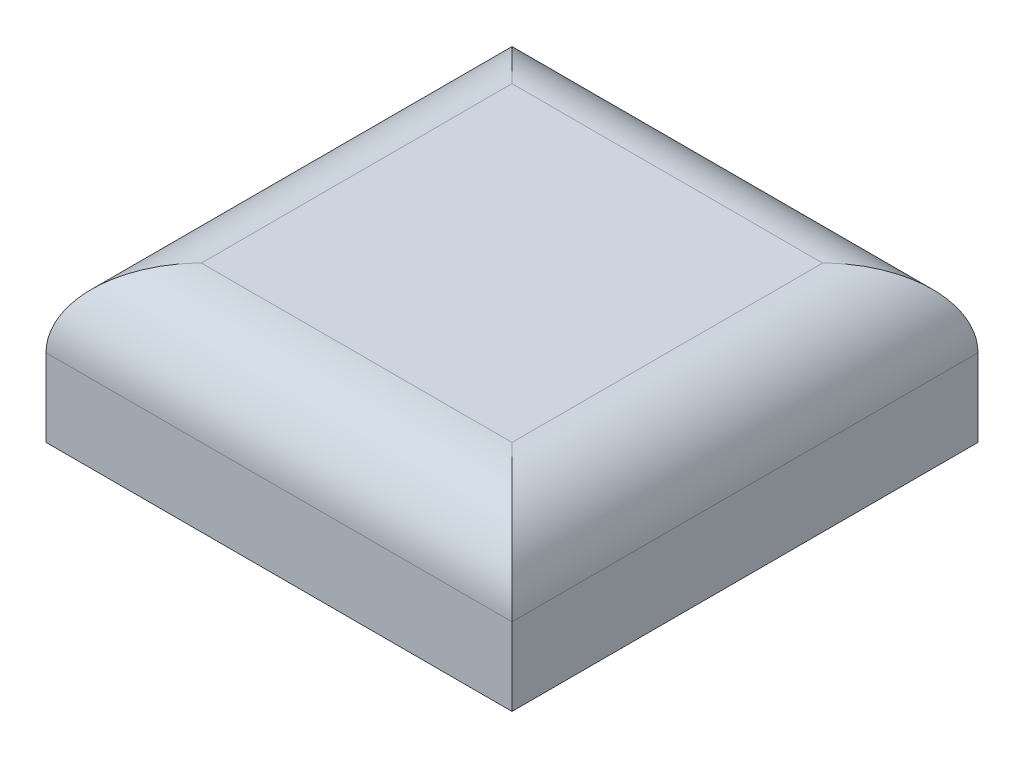
ISO-10303-21;
HEADER;
FILE_DESCRIPTION(('STEP AP214'),'2;1');
FILE_NAME('part.step','',(''),(''),'','','');
FILE_SCHEMA(('AUTOMOTIVE_DESIGN { 1 0 10303 214 1 1 1 1 }'));
ENDSEC;
DATA;
#1=APPLICATION_CONTEXT('core data for automotive mechanical design processes');
#2=APPLICATION_PROTOCOL_DEFINITION('international standard','automotive_design',2000,#1);
#3=PRODUCT_CONTEXT('',#1,'mechanical');
#4=PRODUCT('Part','Part','',(#3));
#5=PRODUCT_RELATED_PRODUCT_CATEGORY('part','',(#4));
#6=PRODUCT_DEFINITION_FORMATION('','',#4);
#7=PRODUCT_DEFINITION_CONTEXT('part definition',#1,'design');
#8=PRODUCT_DEFINITION('design','',#6,#7);
#9=PRODUCT_DEFINITION_SHAPE('','',#8);
#10=(LENGTH_UNIT() NAMED_UNIT(*) SI_UNIT(.MILLI.,.METRE.));
#11=(NAMED_UNIT(*) PLANE_ANGLE_UNIT() SI_UNIT($,.RADIAN.));
#12=(NAMED_UNIT(*) SI_UNIT($,.STERADIAN.) SOLID_ANGLE_UNIT());
#13=UNCERTAINTY_MEASURE_WITH_UNIT(LENGTH_MEASURE(1.E-05),#10,'distance_accuracy_value','');
#14=(GEOMETRIC_REPRESENTATION_CONTEXT(3) GLOBAL_UNCERTAINTY_ASSIGNED_CONTEXT((#13)) GLOBAL_UNIT_ASSIGNED_CONTEXT((#10,
#11,#12)) REPRESENTATION_CONTEXT('',''));
#15=CARTESIAN_POINT('',(0.,0.,0.));
#16=DIRECTION('',(0.,0.,1.));
#17=DIRECTION('',(1.,0.,0.));
#18=AXIS2_PLACEMENT_3D('',#15,#16,#17);
#19=CARTESIAN_POINT('',(-3.02307692307692,4.,-8.33076923076923));
#20=DIRECTION('',(-1.,0.,0.));
#21=DIRECTION('',(0.,0.,1.));
#22=AXIS2_PLACEMENT_3D('',#19,#20,#21);
#23=PLANE('',#22);
#24=DIRECTION('',(0.,-1.,0.));
#25=VECTOR('',#24,1.);
#26=CARTESIAN_POINT('',(-3.02307692307692,4.,-8.33076923076923));
#27=LINE('',#26,#25);
#28=CARTESIAN_POINT('',(-3.02307692307692,2.,-8.33076923076923));
#29=VERTEX_POINT('',#28);
#30=CARTESIAN_POINT('',(-3.02307692307692,0.,-8.33076923076923));
#31=VERTEX_POINT('',#30);
#32=EDGE_CURVE('E90',#29,#31,#27,.T.);
#33=ORIENTED_EDGE('',*,*,#32,.F.);
#34=DIRECTION('',(0.,0.,-1.));
#35=VECTOR('',#34,1.);
#36=CARTESIAN_POINT('',(-3.02307692307692,2.,3.66923076923077));
#37=LINE('',#36,#35);
#38=CARTESIAN_POINT('',(-3.02307692307692,2.,3.66923076923077));
#39=VERTEX_POINT('',#38);
#40=EDGE_CURVE('E60',#29,#39,#37,.F.);
#41=ORIENTED_EDGE('',*,*,#40,.T.);
#42=DIRECTION('',(0.,-1.,0.));
#43=VECTOR('',#42,1.);
#44=CARTESIAN_POINT('',(-3.02307692307692,4.,3.66923076923077));
#45=LINE('',#44,#43);
#46=CARTESIAN_POINT('',(-3.02307692307692,0.,3.66923076923077));
#47=VERTEX_POINT('',#46);
#48=EDGE_CURVE('E110',#39,#47,#45,.T.);
#49=ORIENTED_EDGE('',*,*,#48,.T.);
#50=DIRECTION('',(0.,0.,-1.));
#51=VECTOR('',#50,1.);
#52=CARTESIAN_POINT('',(-3.02307692307692,0.,-8.33076923076923));
#53=LINE('',#52,#51);
#54=EDGE_CURVE('E106',#47,#31,#53,.T.);
#55=ORIENTED_EDGE('',*,*,#54,.T.);
#56=EDGE_LOOP('',(#33,#41,#49,#55));
#57=FACE_BOUND('',#56,.T.);
#58=ADVANCED_FACE('F36',(#57),#23,.F.);
#59=CARTESIAN_POINT('',(-15.0230769230769,4.,-8.33076923076923));
#60=DIRECTION('',(0.,0.,1.));
#61=DIRECTION('',(1.,0.,0.));
#62=AXIS2_PLACEMENT_3D('',#59,#60,#61);
#63=PLANE('',#62);
#64=DIRECTION('',(0.,-1.,0.));
#65=VECTOR('',#64,1.);
#66=CARTESIAN_POINT('',(-15.0230769230769,4.,-8.33076923076923));
#67=LINE('',#66,#65);
#68=CARTESIAN_POINT('',(-15.0230769230769,2.,-8.33076923076923));
#69=VERTEX_POINT('',#68);
#70=CARTESIAN_POINT('',(-15.0230769230769,0.,-8.33076923076923));
#71=VERTEX_POINT('',#70);
#72=EDGE_CURVE('E100',#69,#71,#67,.T.);
#73=ORIENTED_EDGE('',*,*,#72,.F.);
#74=DIRECTION('',(-1.,0.,0.));
#75=VECTOR('',#74,1.);
#76=CARTESIAN_POINT('',(-3.02307692307692,2.,-8.33076923076923));
#77=LINE('',#76,#75);
#78=EDGE_CURVE('E97',#69,#29,#77,.F.);
#79=ORIENTED_EDGE('',*,*,#78,.T.);
#80=ORIENTED_EDGE('',*,*,#32,.T.);
#81=DIRECTION('',(-1.,0.,0.));
#82=VECTOR('',#81,1.);
#83=CARTESIAN_POINT('',(-15.0230769230769,0.,-8.33076923076923));
#84=LINE('',#83,#82);
#85=EDGE_CURVE('E94',#31,#71,#84,.T.);
#86=ORIENTED_EDGE('',*,*,#85,.T.);
#87=EDGE_LOOP('',(#73,#79,#80,#86));
#88=FACE_BOUND('',#87,.T.);
#89=ADVANCED_FACE('F93',(#88),#63,.F.);
#90=CARTESIAN_POINT('',(-15.0230769230769,4.,-8.33076923076923));
#91=DIRECTION('',(1.,0.,0.));
#92=DIRECTION('',(0.,0.,-1.));
#93=AXIS2_PLACEMENT_3D('',#90,#91,#92);
#94=PLANE('',#93);
#95=DIRECTION('',(0.,-1.,0.));
#96=VECTOR('',#95,1.);
#97=CARTESIAN_POINT('',(-15.0230769230769,4.,3.66923076923077));
#98=LINE('',#97,#96);
#99=CARTESIAN_POINT('',(-15.0230769230769,2.,3.66923076923077));
#100=VERTEX_POINT('',#99);
#101=CARTESIAN_POINT('',(-15.0230769230769,0.,3.66923076923077));
#102=VERTEX_POINT('',#101);
#103=EDGE_CURVE('E123',#100,#102,#98,.T.);
#104=ORIENTED_EDGE('',*,*,#103,.F.);
#105=DIRECTION('',(0.,0.,1.));
#106=VECTOR('',#105,1.);
#107=CARTESIAN_POINT('',(-15.0230769230769,2.,-8.33076923076923));
#108=LINE('',#107,#106);
#109=EDGE_CURVE('E11',#100,#69,#108,.F.);
#110=ORIENTED_EDGE('',*,*,#109,.T.);
#111=ORIENTED_EDGE('',*,*,#72,.T.);
#112=DIRECTION('',(0.,0.,1.));
#113=VECTOR('',#112,1.);
#114=CARTESIAN_POINT('',(-15.0230769230769,0.,-8.33076923076923));
#115=LINE('',#114,#113);
#116=EDGE_CURVE('E108',#71,#102,#115,.T.);
#117=ORIENTED_EDGE('',*,*,#116,.T.);
#118=EDGE_LOOP('',(#104,#110,#111,#117));
#119=FACE_BOUND('',#118,.T.);
#120=ADVANCED_FACE('F174',(#119),#94,.F.);
#121=CARTESIAN_POINT('',(-15.0230769230769,4.,3.66923076923077));
#122=DIRECTION('',(0.,0.,-1.));
#123=DIRECTION('',(-1.,0.,0.));
#124=AXIS2_PLACEMENT_3D('',#121,#122,#123);
#125=PLANE('',#124);
#126=ORIENTED_EDGE('',*,*,#48,.F.);
#127=DIRECTION('',(1.,0.,0.));
#128=VECTOR('',#127,1.);
#129=CARTESIAN_POINT('',(-15.0230769230769,2.,3.66923076923077));
#130=LINE('',#129,#128);
#131=EDGE_CURVE('E45',#39,#100,#130,.F.);
#132=ORIENTED_EDGE('',*,*,#131,.T.);
#133=ORIENTED_EDGE('',*,*,#103,.T.);
#134=DIRECTION('',(1.,0.,0.));
#135=VECTOR('',#134,1.);
#136=CARTESIAN_POINT('',(-15.0230769230769,0.,3.66923076923077));
#137=LINE('',#136,#135);
#138=EDGE_CURVE('E120',#102,#47,#137,.T.);
#139=ORIENTED_EDGE('',*,*,#138,.T.);
#140=EDGE_LOOP('',(#126,#132,#133,#139));
#141=FACE_BOUND('',#140,.T.);
#142=ADVANCED_FACE('F165',(#141),#125,.F.);
#143=CARTESIAN_POINT('',(0.,4.,0.));
#144=DIRECTION('',(0.,1.,0.));
#145=DIRECTION('',(0.,0.,1.));
#146=AXIS2_PLACEMENT_3D('',#143,#144,#145);
#147=PLANE('',#146);
#148=DIRECTION('',(0.,0.,-1.));
#149=VECTOR('',#148,1.);
#150=CARTESIAN_POINT('',(-5.02307692307692,4.,-8.33076923076923));
#151=LINE('',#150,#149);
#152=CARTESIAN_POINT('',(-5.02307692307692,4.,1.66923076923077));
#153=VERTEX_POINT('',#152);
#154=CARTESIAN_POINT('',(-5.02307692307692,4.,-6.33076923076923));
#155=VERTEX_POINT('',#154);
#156=EDGE_CURVE('E129',#153,#155,#151,.T.);
#157=ORIENTED_EDGE('',*,*,#156,.T.);
#158=DIRECTION('',(-1.,0.,0.));
#159=VECTOR('',#158,1.);
#160=CARTESIAN_POINT('',(-15.0230769230769,4.,-6.33076923076923));
#161=LINE('',#160,#159);
#162=CARTESIAN_POINT('',(-13.0230769230769,4.,-6.33076923076923));
#163=VERTEX_POINT('',#162);
#164=EDGE_CURVE('E131',#155,#163,#161,.T.);
#165=ORIENTED_EDGE('',*,*,#164,.T.);
#166=DIRECTION('',(0.,0.,1.));
#167=VECTOR('',#166,1.);
#168=CARTESIAN_POINT('',(-13.0230769230769,4.,3.66923076923077));
#169=LINE('',#168,#167);
#170=CARTESIAN_POINT('',(-13.0230769230769,4.,1.66923076923077));
#171=VERTEX_POINT('',#170);
#172=EDGE_CURVE('E99',#163,#171,#169,.T.);
#173=ORIENTED_EDGE('',*,*,#172,.T.);
#174=DIRECTION('',(1.,0.,0.));
#175=VECTOR('',#174,1.);
#176=CARTESIAN_POINT('',(-3.02307692307692,4.,1.66923076923077));
#177=LINE('',#176,#175);
#178=EDGE_CURVE('E127',#171,#153,#177,.T.);
#179=ORIENTED_EDGE('',*,*,#178,.T.);
#180=EDGE_LOOP('',(#157,#165,#173,#179));
#181=FACE_BOUND('',#180,.T.);
#182=ADVANCED_FACE('F156',(#181),#147,.T.);
#183=CARTESIAN_POINT('',(0.,0.,0.));
#184=DIRECTION('',(0.,1.,0.));
#185=DIRECTION('',(0.,0.,1.));
#186=AXIS2_PLACEMENT_3D('',#183,#184,#185);
#187=PLANE('',#186);
#188=CARTESIAN_POINT('',(-9.02307692307692,0.,-2.33076923076923));
#189=DIRECTION('',(0.,-1.,0.));
#190=DIRECTION('',(0.,0.,-1.));
#191=AXIS2_PLACEMENT_3D('',#188,#189,#190);
#192=CIRCLE('',#191,2.);
#193=CARTESIAN_POINT('',(-9.02307692307692,0.,-4.33076923076923));
#194=VERTEX_POINT('',#193);
#195=EDGE_CURVE('E115',#194,#194,#192,.T.);
#196=ORIENTED_EDGE('',*,*,#195,.F.);
#197=EDGE_LOOP('',(#196));
#198=FACE_BOUND('',#197,.T.);
#199=ORIENTED_EDGE('',*,*,#54,.F.);
#200=ORIENTED_EDGE('',*,*,#138,.F.);
#201=ORIENTED_EDGE('',*,*,#116,.F.);
#202=ORIENTED_EDGE('',*,*,#85,.F.);
#203=EDGE_LOOP('',(#199,#200,#201,#202));
#204=FACE_BOUND('',#203,.T.);
#205=ADVANCED_FACE('F104',(#198,#204),#187,.F.);
#206=CARTESIAN_POINT('',(-9.02307692307692,2.,-2.33076923076923));
#207=DIRECTION('',(0.,-1.,0.));
#208=DIRECTION('',(0.,0.,-1.));
#209=AXIS2_PLACEMENT_3D('',#206,#207,#208);
#210=CYLINDRICAL_SURFACE('',#209,2.);
#211=CARTESIAN_POINT('',(-9.02307692307692,2.,-2.33076923076923));
#212=DIRECTION('',(0.,-1.,0.));
#213=DIRECTION('',(0.,0.,-1.));
#214=AXIS2_PLACEMENT_3D('',#211,#212,#213);
#215=CIRCLE('',#214,2.);
#216=CARTESIAN_POINT('',(-9.02307692307692,2.,-4.33076923076923));
#217=VERTEX_POINT('',#216);
#218=EDGE_CURVE('E112',#217,#217,#215,.T.);
#219=ORIENTED_EDGE('',*,*,#218,.F.);
#220=EDGE_LOOP('',(#219));
#221=FACE_BOUND('',#220,.T.);
#222=ORIENTED_EDGE('',*,*,#195,.T.);
#223=EDGE_LOOP('',(#222));
#224=FACE_BOUND('',#223,.T.);
#225=ADVANCED_FACE('F153',(#221,#224),#210,.F.);
#226=CARTESIAN_POINT('',(-9.02307692307692,2.,-2.33076923076923));
#227=DIRECTION('',(0.,-1.,0.));
#228=DIRECTION('',(0.,0.,-1.));
#229=AXIS2_PLACEMENT_3D('',#226,#227,#228);
#230=PLANE('',#229);
#231=ORIENTED_EDGE('',*,*,#218,.T.);
#232=EDGE_LOOP('',(#231));
#233=FACE_BOUND('',#232,.T.);
#234=ADVANCED_FACE('F162',(#233),#230,.T.);
#235=CARTESIAN_POINT('',(0.,2.,1.66923076923077));
#236=DIRECTION('',(-1.,0.,0.));
#237=DIRECTION('',(0.,0.,1.));
#238=AXIS2_PLACEMENT_3D('',#235,#236,#237);
#239=CYLINDRICAL_SURFACE('',#238,2.);
#240=CARTESIAN_POINT('',(-13.0230769230769,2.,1.66923076923077));
#241=DIRECTION('',(-0.707106781186548,0.,-0.707106781186547));
#242=DIRECTION('',(0.707106781186547,0.,-0.707106781186548));
#243=AXIS2_PLACEMENT_3D('',#240,#241,#242);
#244=ELLIPSE('',#243,2.82842712474619,2.);
#245=EDGE_CURVE('E140',#100,#171,#244,.T.);
#246=ORIENTED_EDGE('',*,*,#245,.F.);
#247=ORIENTED_EDGE('',*,*,#131,.F.);
#248=CARTESIAN_POINT('',(-5.02307692307692,2.,1.66923076923077));
#249=DIRECTION('',(-0.707106781186547,0.,0.707106781186548));
#250=DIRECTION('',(-0.707106781186548,0.,-0.707106781186547));
#251=AXIS2_PLACEMENT_3D('',#248,#249,#250);
#252=ELLIPSE('',#251,2.82842712474619,2.);
#253=EDGE_CURVE('E40',#153,#39,#252,.F.);
#254=ORIENTED_EDGE('',*,*,#253,.F.);
#255=ORIENTED_EDGE('',*,*,#178,.F.);
#256=EDGE_LOOP('',(#246,#247,#254,#255));
#257=FACE_BOUND('',#256,.T.);
#258=ADVANCED_FACE('F38',(#257),#239,.T.);
#259=CARTESIAN_POINT('',(-5.02307692307692,2.,0.));
#260=DIRECTION('',(0.,0.,1.));
#261=DIRECTION('',(1.,0.,0.));
#262=AXIS2_PLACEMENT_3D('',#259,#260,#261);
#263=CYLINDRICAL_SURFACE('',#262,2.);
#264=ORIENTED_EDGE('',*,*,#253,.T.);
#265=ORIENTED_EDGE('',*,*,#40,.F.);
#266=CARTESIAN_POINT('',(-5.02307692307692,2.,-6.33076923076923));
#267=DIRECTION('',(0.707106781186548,0.,0.707106781186547));
#268=DIRECTION('',(-0.707106781186547,0.,0.707106781186548));
#269=AXIS2_PLACEMENT_3D('',#266,#267,#268);
#270=ELLIPSE('',#269,2.82842712474619,2.);
#271=EDGE_CURVE('E139',#155,#29,#270,.F.);
#272=ORIENTED_EDGE('',*,*,#271,.F.);
#273=ORIENTED_EDGE('',*,*,#156,.F.);
#274=EDGE_LOOP('',(#264,#265,#272,#273));
#275=FACE_BOUND('',#274,.T.);
#276=ADVANCED_FACE('F184',(#275),#263,.T.);
#277=CARTESIAN_POINT('',(-13.0230769230769,2.,0.));
#278=DIRECTION('',(0.,0.,-1.));
#279=DIRECTION('',(-1.,0.,0.));
#280=AXIS2_PLACEMENT_3D('',#277,#278,#279);
#281=CYLINDRICAL_SURFACE('',#280,2.);
#282=ORIENTED_EDGE('',*,*,#245,.T.);
#283=ORIENTED_EDGE('',*,*,#172,.F.);
#284=CARTESIAN_POINT('',(-13.0230769230769,2.,-6.33076923076923));
#285=DIRECTION('',(0.707106781186547,0.,-0.707106781186548));
#286=DIRECTION('',(-0.707106781186548,0.,-0.707106781186547));
#287=AXIS2_PLACEMENT_3D('',#284,#285,#286);
#288=ELLIPSE('',#287,2.82842712474619,2.);
#289=EDGE_CURVE('E137',#69,#163,#288,.T.);
#290=ORIENTED_EDGE('',*,*,#289,.F.);
#291=ORIENTED_EDGE('',*,*,#109,.F.);
#292=EDGE_LOOP('',(#282,#283,#290,#291));
#293=FACE_BOUND('',#292,.T.);
#294=ADVANCED_FACE('F181',(#293),#281,.T.);
#295=CARTESIAN_POINT('',(0.,2.,-6.33076923076923));
#296=DIRECTION('',(1.,0.,0.));
#297=DIRECTION('',(0.,0.,-1.));
#298=AXIS2_PLACEMENT_3D('',#295,#296,#297);
#299=CYLINDRICAL_SURFACE('',#298,2.);
#300=ORIENTED_EDGE('',*,*,#271,.T.);
#301=ORIENTED_EDGE('',*,*,#78,.F.);
#302=ORIENTED_EDGE('',*,*,#289,.T.);
#303=ORIENTED_EDGE('',*,*,#164,.F.);
#304=EDGE_LOOP('',(#300,#301,#302,#303));
#305=FACE_BOUND('',#304,.T.);
#306=ADVANCED_FACE('F178',(#305),#299,.T.);
#307=CLOSED_SHELL('',(#58,#89,#120,#142,#182,#205,#225,#234,#258,#276,#294,#306));
#308=MANIFOLD_SOLID_BREP('B2',#307);
#309=ADVANCED_BREP_SHAPE_REPRESENTATION('',(#18,#308),#14);
#310=SHAPE_DEFINITION_REPRESENTATION(#9,#309);
ENDSEC;
END-ISO-10303-21;
